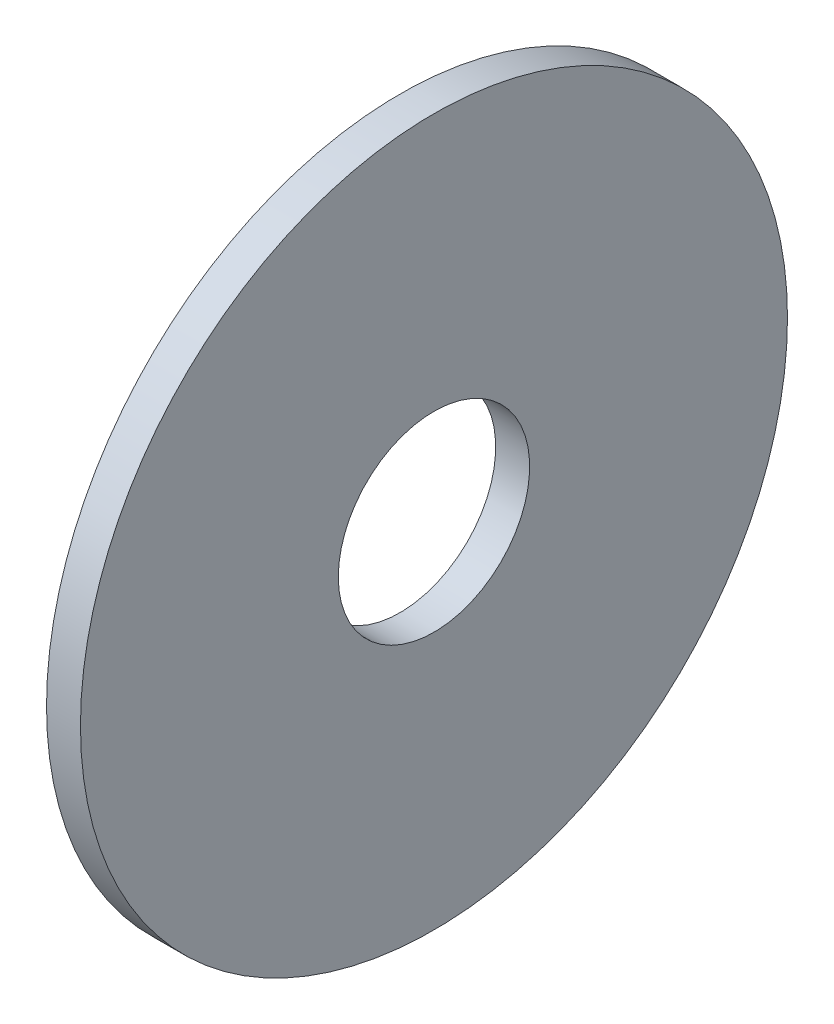
ISO-10303-21;
HEADER;
FILE_DESCRIPTION(('STEP AP214'),'2;1');
FILE_NAME('part.step','',(''),(''),'','','');
FILE_SCHEMA(('AUTOMOTIVE_DESIGN { 1 0 10303 214 1 1 1 1 }'));
ENDSEC;
DATA;
#1=APPLICATION_CONTEXT('core data for automotive mechanical design processes');
#2=APPLICATION_PROTOCOL_DEFINITION('international standard','automotive_design',2000,#1);
#3=PRODUCT_CONTEXT('',#1,'mechanical');
#4=PRODUCT('Part','Part','',(#3));
#5=PRODUCT_RELATED_PRODUCT_CATEGORY('part','',(#4));
#6=PRODUCT_DEFINITION_FORMATION('','',#4);
#7=PRODUCT_DEFINITION_CONTEXT('part definition',#1,'design');
#8=PRODUCT_DEFINITION('design','',#6,#7);
#9=PRODUCT_DEFINITION_SHAPE('','',#8);
#10=(LENGTH_UNIT() NAMED_UNIT(*) SI_UNIT(.MILLI.,.METRE.));
#11=(NAMED_UNIT(*) PLANE_ANGLE_UNIT() SI_UNIT($,.RADIAN.));
#12=(NAMED_UNIT(*) SI_UNIT($,.STERADIAN.) SOLID_ANGLE_UNIT());
#13=UNCERTAINTY_MEASURE_WITH_UNIT(LENGTH_MEASURE(1.E-05),#10,'distance_accuracy_value','');
#14=(GEOMETRIC_REPRESENTATION_CONTEXT(3) GLOBAL_UNCERTAINTY_ASSIGNED_CONTEXT((#13)) GLOBAL_UNIT_ASSIGNED_CONTEXT((#10,
#11,#12)) REPRESENTATION_CONTEXT('',''));
#15=CARTESIAN_POINT('',(0.,0.,0.));
#16=DIRECTION('',(0.,0.,1.));
#17=DIRECTION('',(1.,0.,0.));
#18=AXIS2_PLACEMENT_3D('',#15,#16,#17);
#19=CARTESIAN_POINT('',(0.,0.,0.));
#20=DIRECTION('',(1.,0.,0.));
#21=DIRECTION('',(0.,0.,-1.));
#22=AXIS2_PLACEMENT_3D('',#19,#20,#21);
#23=PLANE('',#22);
#24=CARTESIAN_POINT('',(0.,0.,0.));
#25=DIRECTION('',(-1.,0.,0.));
#26=DIRECTION('',(0.,0.,1.));
#27=AXIS2_PLACEMENT_3D('',#24,#25,#26);
#28=CIRCLE('',#27,5.1562);
#29=CARTESIAN_POINT('',(0.,0.,5.1562));
#30=VERTEX_POINT('',#29);
#31=EDGE_CURVE('E34',#30,#30,#28,.F.);
#32=ORIENTED_EDGE('',*,*,#31,.T.);
#33=EDGE_LOOP('',(#32));
#34=FACE_BOUND('',#33,.T.);
#35=CARTESIAN_POINT('',(0.,0.,0.));
#36=DIRECTION('',(-1.,0.,0.));
#37=DIRECTION('',(0.,0.,1.));
#38=AXIS2_PLACEMENT_3D('',#35,#36,#37);
#39=CIRCLE('',#38,19.05);
#40=CARTESIAN_POINT('',(0.,0.,19.05));
#41=VERTEX_POINT('',#40);
#42=EDGE_CURVE('E19',#41,#41,#39,.F.);
#43=ORIENTED_EDGE('',*,*,#42,.F.);
#44=EDGE_LOOP('',(#43));
#45=FACE_BOUND('',#44,.T.);
#46=ADVANCED_FACE('F16',(#34,#45),#23,.F.);
#47=CARTESIAN_POINT('',(1.8288,0.,0.));
#48=DIRECTION('',(-1.,0.,0.));
#49=DIRECTION('',(0.,0.,1.));
#50=AXIS2_PLACEMENT_3D('',#47,#48,#49);
#51=CYLINDRICAL_SURFACE('',#50,19.05);
#52=ORIENTED_EDGE('',*,*,#42,.T.);
#53=EDGE_LOOP('',(#52));
#54=FACE_BOUND('',#53,.T.);
#55=CARTESIAN_POINT('',(1.8288,0.,0.));
#56=DIRECTION('',(-1.,0.,0.));
#57=DIRECTION('',(0.,0.,1.));
#58=AXIS2_PLACEMENT_3D('',#55,#56,#57);
#59=CIRCLE('',#58,19.05);
#60=CARTESIAN_POINT('',(1.8288,0.,19.05));
#61=VERTEX_POINT('',#60);
#62=EDGE_CURVE('E24',#61,#61,#59,.F.);
#63=ORIENTED_EDGE('',*,*,#62,.F.);
#64=EDGE_LOOP('',(#63));
#65=FACE_BOUND('',#64,.T.);
#66=ADVANCED_FACE('F44',(#54,#65),#51,.T.);
#67=CARTESIAN_POINT('',(1.8288,0.,0.));
#68=DIRECTION('',(-1.,0.,0.));
#69=DIRECTION('',(0.,0.,1.));
#70=AXIS2_PLACEMENT_3D('',#67,#68,#69);
#71=CYLINDRICAL_SURFACE('',#70,5.1562);
#72=CARTESIAN_POINT('',(1.8288,0.,0.));
#73=DIRECTION('',(-1.,0.,0.));
#74=DIRECTION('',(0.,0.,1.));
#75=AXIS2_PLACEMENT_3D('',#72,#73,#74);
#76=CIRCLE('',#75,5.1562);
#77=CARTESIAN_POINT('',(1.8288,0.,5.1562));
#78=VERTEX_POINT('',#77);
#79=EDGE_CURVE('E10',#78,#78,#76,.T.);
#80=ORIENTED_EDGE('',*,*,#79,.F.);
#81=EDGE_LOOP('',(#80));
#82=FACE_BOUND('',#81,.T.);
#83=ORIENTED_EDGE('',*,*,#31,.F.);
#84=EDGE_LOOP('',(#83));
#85=FACE_BOUND('',#84,.T.);
#86=ADVANCED_FACE('F52',(#82,#85),#71,.F.);
#87=CARTESIAN_POINT('',(1.8288,0.,0.));
#88=DIRECTION('',(1.,0.,0.));
#89=DIRECTION('',(0.,0.,-1.));
#90=AXIS2_PLACEMENT_3D('',#87,#88,#89);
#91=PLANE('',#90);
#92=ORIENTED_EDGE('',*,*,#79,.T.);
#93=EDGE_LOOP('',(#92));
#94=FACE_BOUND('',#93,.T.);
#95=ORIENTED_EDGE('',*,*,#62,.T.);
#96=EDGE_LOOP('',(#95));
#97=FACE_BOUND('',#96,.T.);
#98=ADVANCED_FACE('F53',(#94,#97),#91,.T.);
#99=CLOSED_SHELL('',(#46,#66,#86,#98));
#100=MANIFOLD_SOLID_BREP('B1',#99);
#101=ADVANCED_BREP_SHAPE_REPRESENTATION('',(#18,#100),#14);
#102=SHAPE_DEFINITION_REPRESENTATION(#9,#101);
ENDSEC;
END-ISO-10303-21;
